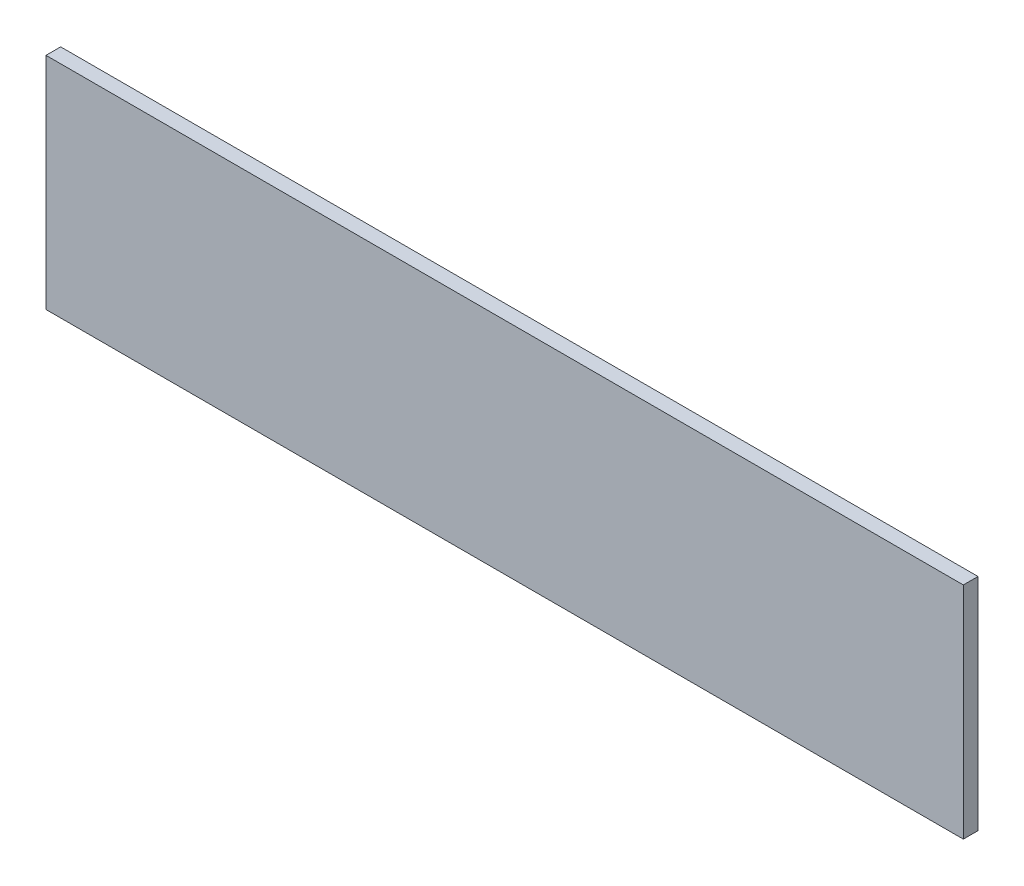
ISO-10303-21;
HEADER;
FILE_DESCRIPTION(('STEP AP214'),'2;1');
FILE_NAME('part.step','',(''),(''),'','','');
FILE_SCHEMA(('AUTOMOTIVE_DESIGN { 1 0 10303 214 1 1 1 1 }'));
ENDSEC;
DATA;
#1=APPLICATION_CONTEXT('core data for automotive mechanical design processes');
#2=APPLICATION_PROTOCOL_DEFINITION('international standard','automotive_design',2000,#1);
#3=PRODUCT_CONTEXT('',#1,'mechanical');
#4=PRODUCT('Part','Part','',(#3));
#5=PRODUCT_RELATED_PRODUCT_CATEGORY('part','',(#4));
#6=PRODUCT_DEFINITION_FORMATION('','',#4);
#7=PRODUCT_DEFINITION_CONTEXT('part definition',#1,'design');
#8=PRODUCT_DEFINITION('design','',#6,#7);
#9=PRODUCT_DEFINITION_SHAPE('','',#8);
#10=(LENGTH_UNIT() NAMED_UNIT(*) SI_UNIT(.MILLI.,.METRE.));
#11=(NAMED_UNIT(*) PLANE_ANGLE_UNIT() SI_UNIT($,.RADIAN.));
#12=(NAMED_UNIT(*) SI_UNIT($,.STERADIAN.) SOLID_ANGLE_UNIT());
#13=UNCERTAINTY_MEASURE_WITH_UNIT(LENGTH_MEASURE(1.E-05),#10,'distance_accuracy_value','');
#14=(GEOMETRIC_REPRESENTATION_CONTEXT(3) GLOBAL_UNCERTAINTY_ASSIGNED_CONTEXT((#13)) GLOBAL_UNIT_ASSIGNED_CONTEXT((#10,
#11,#12)) REPRESENTATION_CONTEXT('',''));
#15=CARTESIAN_POINT('',(0.,0.,0.));
#16=DIRECTION('',(0.,0.,1.));
#17=DIRECTION('',(1.,0.,0.));
#18=AXIS2_PLACEMENT_3D('',#15,#16,#17);
#19=CARTESIAN_POINT('',(250.,-60.,8.));
#20=DIRECTION('',(-1.,0.,0.));
#21=DIRECTION('',(0.,0.,1.));
#22=AXIS2_PLACEMENT_3D('',#19,#20,#21);
#23=PLANE('',#22);
#24=DIRECTION('',(0.,1.,0.));
#25=VECTOR('',#24,1.);
#26=CARTESIAN_POINT('',(250.,-60.,0.));
#27=LINE('',#26,#25);
#28=CARTESIAN_POINT('',(250.,-60.,0.));
#29=VERTEX_POINT('',#28);
#30=CARTESIAN_POINT('',(250.,60.,0.));
#31=VERTEX_POINT('',#30);
#32=EDGE_CURVE('E107',#29,#31,#27,.T.);
#33=ORIENTED_EDGE('',*,*,#32,.T.);
#34=DIRECTION('',(0.,0.,-1.));
#35=VECTOR('',#34,1.);
#36=CARTESIAN_POINT('',(250.,60.,8.));
#37=LINE('',#36,#35);
#38=CARTESIAN_POINT('',(250.,60.,8.));
#39=VERTEX_POINT('',#38);
#40=EDGE_CURVE('E11',#39,#31,#37,.T.);
#41=ORIENTED_EDGE('',*,*,#40,.F.);
#42=DIRECTION('',(0.,1.,0.));
#43=VECTOR('',#42,1.);
#44=CARTESIAN_POINT('',(250.,-60.,8.));
#45=LINE('',#44,#43);
#46=CARTESIAN_POINT('',(250.,-60.,8.));
#47=VERTEX_POINT('',#46);
#48=EDGE_CURVE('E91',#47,#39,#45,.T.);
#49=ORIENTED_EDGE('',*,*,#48,.F.);
#50=DIRECTION('',(0.,0.,-1.));
#51=VECTOR('',#50,1.);
#52=CARTESIAN_POINT('',(250.,-60.,8.));
#53=LINE('',#52,#51);
#54=EDGE_CURVE('E103',#47,#29,#53,.T.);
#55=ORIENTED_EDGE('',*,*,#54,.T.);
#56=EDGE_LOOP('',(#33,#41,#49,#55));
#57=FACE_BOUND('',#56,.T.);
#58=ADVANCED_FACE('F39',(#57),#23,.F.);
#59=CARTESIAN_POINT('',(-250.,60.,8.));
#60=DIRECTION('',(0.,-1.,0.));
#61=DIRECTION('',(0.,0.,-1.));
#62=AXIS2_PLACEMENT_3D('',#59,#60,#61);
#63=PLANE('',#62);
#64=DIRECTION('',(-1.,0.,0.));
#65=VECTOR('',#64,1.);
#66=CARTESIAN_POINT('',(-250.,60.,0.));
#67=LINE('',#66,#65);
#68=CARTESIAN_POINT('',(-250.,60.,0.));
#69=VERTEX_POINT('',#68);
#70=EDGE_CURVE('E96',#31,#69,#67,.T.);
#71=ORIENTED_EDGE('',*,*,#70,.T.);
#72=DIRECTION('',(0.,0.,-1.));
#73=VECTOR('',#72,1.);
#74=CARTESIAN_POINT('',(-250.,60.,8.));
#75=LINE('',#74,#73);
#76=CARTESIAN_POINT('',(-250.,60.,8.));
#77=VERTEX_POINT('',#76);
#78=EDGE_CURVE('E48',#77,#69,#75,.T.);
#79=ORIENTED_EDGE('',*,*,#78,.F.);
#80=DIRECTION('',(-1.,0.,0.));
#81=VECTOR('',#80,1.);
#82=CARTESIAN_POINT('',(-250.,60.,8.));
#83=LINE('',#82,#81);
#84=EDGE_CURVE('E86',#39,#77,#83,.T.);
#85=ORIENTED_EDGE('',*,*,#84,.F.);
#86=ORIENTED_EDGE('',*,*,#40,.T.);
#87=EDGE_LOOP('',(#71,#79,#85,#86));
#88=FACE_BOUND('',#87,.T.);
#89=ADVANCED_FACE('F95',(#88),#63,.F.);
#90=CARTESIAN_POINT('',(-250.,-60.,8.));
#91=DIRECTION('',(1.,0.,0.));
#92=DIRECTION('',(0.,0.,-1.));
#93=AXIS2_PLACEMENT_3D('',#90,#91,#92);
#94=PLANE('',#93);
#95=DIRECTION('',(0.,-1.,0.));
#96=VECTOR('',#95,1.);
#97=CARTESIAN_POINT('',(-250.,-60.,0.));
#98=LINE('',#97,#96);
#99=CARTESIAN_POINT('',(-250.,-60.,0.));
#100=VERTEX_POINT('',#99);
#101=EDGE_CURVE('E73',#69,#100,#98,.T.);
#102=ORIENTED_EDGE('',*,*,#101,.T.);
#103=DIRECTION('',(0.,0.,-1.));
#104=VECTOR('',#103,1.);
#105=CARTESIAN_POINT('',(-250.,-60.,8.));
#106=LINE('',#105,#104);
#107=CARTESIAN_POINT('',(-250.,-60.,8.));
#108=VERTEX_POINT('',#107);
#109=EDGE_CURVE('E98',#108,#100,#106,.T.);
#110=ORIENTED_EDGE('',*,*,#109,.F.);
#111=DIRECTION('',(0.,-1.,0.));
#112=VECTOR('',#111,1.);
#113=CARTESIAN_POINT('',(-250.,-60.,8.));
#114=LINE('',#113,#112);
#115=EDGE_CURVE('E89',#77,#108,#114,.T.);
#116=ORIENTED_EDGE('',*,*,#115,.F.);
#117=ORIENTED_EDGE('',*,*,#78,.T.);
#118=EDGE_LOOP('',(#102,#110,#116,#117));
#119=FACE_BOUND('',#118,.T.);
#120=ADVANCED_FACE('F99',(#119),#94,.F.);
#121=CARTESIAN_POINT('',(-250.,-60.,8.));
#122=DIRECTION('',(0.,1.,0.));
#123=DIRECTION('',(0.,0.,1.));
#124=AXIS2_PLACEMENT_3D('',#121,#122,#123);
#125=PLANE('',#124);
#126=DIRECTION('',(1.,0.,0.));
#127=VECTOR('',#126,1.);
#128=CARTESIAN_POINT('',(-250.,-60.,0.));
#129=LINE('',#128,#127);
#130=EDGE_CURVE('E79',#100,#29,#129,.T.);
#131=ORIENTED_EDGE('',*,*,#130,.T.);
#132=ORIENTED_EDGE('',*,*,#54,.F.);
#133=DIRECTION('',(1.,0.,0.));
#134=VECTOR('',#133,1.);
#135=CARTESIAN_POINT('',(-250.,-60.,8.));
#136=LINE('',#135,#134);
#137=EDGE_CURVE('E56',#108,#47,#136,.T.);
#138=ORIENTED_EDGE('',*,*,#137,.F.);
#139=ORIENTED_EDGE('',*,*,#109,.T.);
#140=EDGE_LOOP('',(#131,#132,#138,#139));
#141=FACE_BOUND('',#140,.T.);
#142=ADVANCED_FACE('F120',(#141),#125,.F.);
#143=CARTESIAN_POINT('',(0.,0.,8.));
#144=DIRECTION('',(0.,0.,-1.));
#145=DIRECTION('',(-1.,0.,0.));
#146=AXIS2_PLACEMENT_3D('',#143,#144,#145);
#147=PLANE('',#146);
#148=ORIENTED_EDGE('',*,*,#48,.T.);
#149=ORIENTED_EDGE('',*,*,#84,.T.);
#150=ORIENTED_EDGE('',*,*,#115,.T.);
#151=ORIENTED_EDGE('',*,*,#137,.T.);
#152=EDGE_LOOP('',(#148,#149,#150,#151));
#153=FACE_BOUND('',#152,.T.);
#154=ADVANCED_FACE('F87',(#153),#147,.F.);
#155=CARTESIAN_POINT('',(0.,0.,0.));
#156=DIRECTION('',(0.,0.,-1.));
#157=DIRECTION('',(-1.,0.,0.));
#158=AXIS2_PLACEMENT_3D('',#155,#156,#157);
#159=PLANE('',#158);
#160=ORIENTED_EDGE('',*,*,#32,.F.);
#161=ORIENTED_EDGE('',*,*,#130,.F.);
#162=ORIENTED_EDGE('',*,*,#101,.F.);
#163=ORIENTED_EDGE('',*,*,#70,.F.);
#164=EDGE_LOOP('',(#160,#161,#162,#163));
#165=FACE_BOUND('',#164,.T.);
#166=ADVANCED_FACE('F123',(#165),#159,.T.);
#167=CLOSED_SHELL('',(#58,#89,#120,#142,#154,#166));
#168=MANIFOLD_SOLID_BREP('B2',#167);
#169=ADVANCED_BREP_SHAPE_REPRESENTATION('',(#18,#168),#14);
#170=SHAPE_DEFINITION_REPRESENTATION(#9,#169);
ENDSEC;
END-ISO-10303-21;
